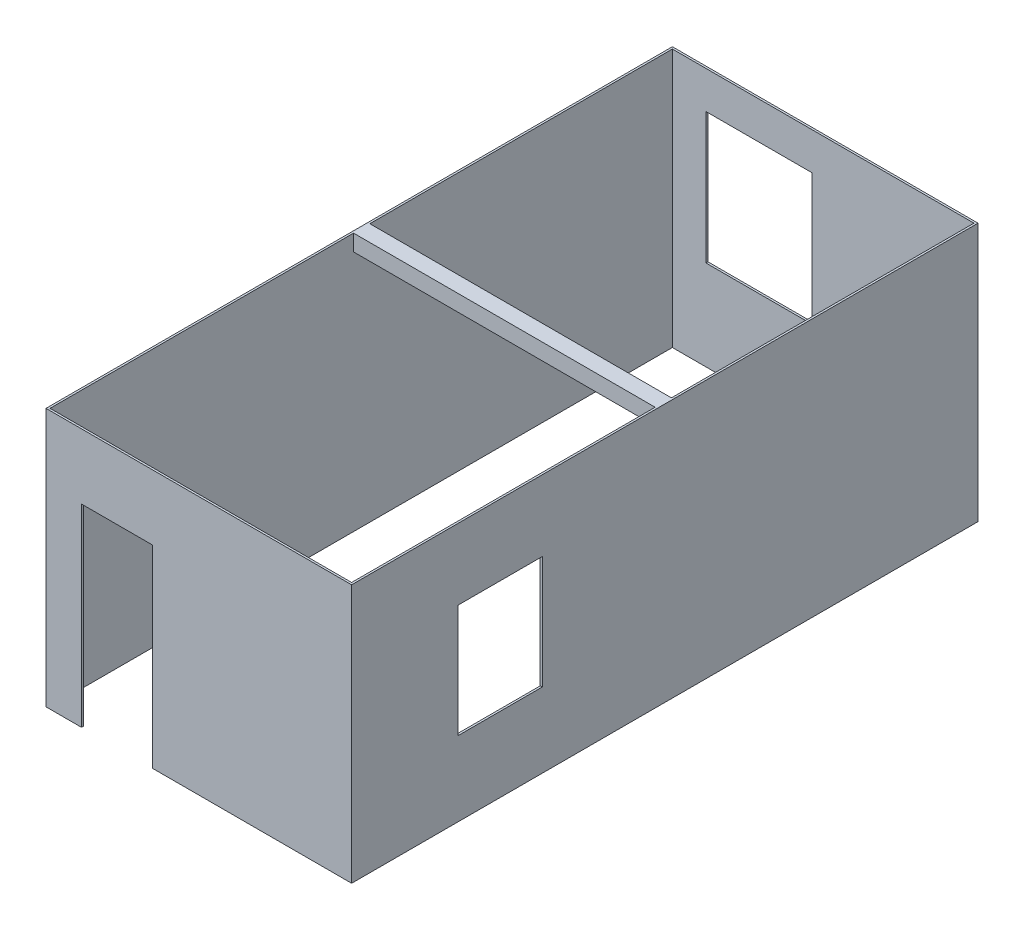
ISO-10303-21;
HEADER;
FILE_DESCRIPTION(('STEP AP214'),'2;1');
FILE_NAME('part.step','',(''),(''),'','','');
FILE_SCHEMA(('AUTOMOTIVE_DESIGN { 1 0 10303 214 1 1 1 1 }'));
ENDSEC;
DATA;
#1=APPLICATION_CONTEXT('core data for automotive mechanical design processes');
#2=APPLICATION_PROTOCOL_DEFINITION('international standard','automotive_design',2000,#1);
#3=PRODUCT_CONTEXT('',#1,'mechanical');
#4=PRODUCT('Part','Part','',(#3));
#5=PRODUCT_RELATED_PRODUCT_CATEGORY('part','',(#4));
#6=PRODUCT_DEFINITION_FORMATION('','',#4);
#7=PRODUCT_DEFINITION_CONTEXT('part definition',#1,'design');
#8=PRODUCT_DEFINITION('design','',#6,#7);
#9=PRODUCT_DEFINITION_SHAPE('','',#8);
#10=(LENGTH_UNIT() NAMED_UNIT(*) SI_UNIT(.MILLI.,.METRE.));
#11=(NAMED_UNIT(*) PLANE_ANGLE_UNIT() SI_UNIT($,.RADIAN.));
#12=(NAMED_UNIT(*) SI_UNIT($,.STERADIAN.) SOLID_ANGLE_UNIT());
#13=UNCERTAINTY_MEASURE_WITH_UNIT(LENGTH_MEASURE(1.E-05),#10,'distance_accuracy_value','');
#14=(GEOMETRIC_REPRESENTATION_CONTEXT(3) GLOBAL_UNCERTAINTY_ASSIGNED_CONTEXT((#13)) GLOBAL_UNIT_ASSIGNED_CONTEXT((#10,
#11,#12)) REPRESENTATION_CONTEXT('',''));
#15=CARTESIAN_POINT('',(0.,0.,0.));
#16=DIRECTION('',(0.,0.,1.));
#17=DIRECTION('',(1.,0.,0.));
#18=AXIS2_PLACEMENT_3D('',#15,#16,#17);
#19=CARTESIAN_POINT('',(0.,2700.,0.));
#20=DIRECTION('',(-1.,0.,0.));
#21=DIRECTION('',(0.,0.,1.));
#22=AXIS2_PLACEMENT_3D('',#19,#20,#21);
#23=PLANE('',#22);
#24=DIRECTION('',(0.,-1.,0.));
#25=VECTOR('',#24,1.);
#26=CARTESIAN_POINT('',(0.,1960.,-1970.));
#27=LINE('',#26,#25);
#28=CARTESIAN_POINT('',(0.,1960.,-1970.));
#29=VERTEX_POINT('',#28);
#30=CARTESIAN_POINT('',(0.,780.,-1970.));
#31=VERTEX_POINT('',#30);
#32=EDGE_CURVE('E277',#29,#31,#27,.T.);
#33=ORIENTED_EDGE('',*,*,#32,.F.);
#34=DIRECTION('',(0.,0.,-1.));
#35=VECTOR('',#34,1.);
#36=CARTESIAN_POINT('',(0.,1960.,-1970.));
#37=LINE('',#36,#35);
#38=CARTESIAN_POINT('',(0.,1960.,-1090.));
#39=VERTEX_POINT('',#38);
#40=EDGE_CURVE('E288',#39,#29,#37,.T.);
#41=ORIENTED_EDGE('',*,*,#40,.F.);
#42=DIRECTION('',(0.,1.,0.));
#43=VECTOR('',#42,1.);
#44=CARTESIAN_POINT('',(0.,1960.,-1090.));
#45=LINE('',#44,#43);
#46=CARTESIAN_POINT('',(0.,780.,-1090.));
#47=VERTEX_POINT('',#46);
#48=EDGE_CURVE('E302',#47,#39,#45,.T.);
#49=ORIENTED_EDGE('',*,*,#48,.F.);
#50=DIRECTION('',(0.,0.,1.));
#51=VECTOR('',#50,1.);
#52=CARTESIAN_POINT('',(0.,780.,-1970.));
#53=LINE('',#52,#51);
#54=EDGE_CURVE('E299',#31,#47,#53,.T.);
#55=ORIENTED_EDGE('',*,*,#54,.F.);
#56=EDGE_LOOP('',(#33,#41,#49,#55));
#57=FACE_BOUND('',#56,.T.);
#58=DIRECTION('',(0.,0.,-1.));
#59=VECTOR('',#58,1.);
#60=CARTESIAN_POINT('',(0.,2700.,0.));
#61=LINE('',#60,#59);
#62=CARTESIAN_POINT('',(0.,2700.,0.));
#63=VERTEX_POINT('',#62);
#64=CARTESIAN_POINT('',(0.,2700.,-3170.));
#65=VERTEX_POINT('',#64);
#66=EDGE_CURVE('E342',#63,#65,#61,.T.);
#67=ORIENTED_EDGE('',*,*,#66,.T.);
#68=DIRECTION('',(0.,1.,0.));
#69=VECTOR('',#68,1.);
#70=CARTESIAN_POINT('',(0.,2700.,-3170.));
#71=LINE('',#70,#69);
#72=CARTESIAN_POINT('',(0.,2530.,-3170.));
#73=VERTEX_POINT('',#72);
#74=EDGE_CURVE('E240',#73,#65,#71,.T.);
#75=ORIENTED_EDGE('',*,*,#74,.F.);
#76=DIRECTION('',(0.,0.,1.));
#77=VECTOR('',#76,1.);
#78=CARTESIAN_POINT('',(0.,2530.,-3340.));
#79=LINE('',#78,#77);
#80=CARTESIAN_POINT('',(0.,2530.,-3340.));
#81=VERTEX_POINT('',#80);
#82=EDGE_CURVE('E243',#81,#73,#79,.T.);
#83=ORIENTED_EDGE('',*,*,#82,.F.);
#84=DIRECTION('',(0.,-1.,0.));
#85=VECTOR('',#84,1.);
#86=CARTESIAN_POINT('',(0.,2700.,-3340.));
#87=LINE('',#86,#85);
#88=CARTESIAN_POINT('',(0.,2700.,-3340.));
#89=VERTEX_POINT('',#88);
#90=EDGE_CURVE('E74',#89,#81,#87,.T.);
#91=ORIENTED_EDGE('',*,*,#90,.F.);
#92=CARTESIAN_POINT('',(0.,2700.,-6500.));
#93=VERTEX_POINT('',#92);
#94=EDGE_CURVE('E346',#89,#93,#61,.T.);
#95=ORIENTED_EDGE('',*,*,#94,.T.);
#96=DIRECTION('',(0.,-1.,0.));
#97=VECTOR('',#96,1.);
#98=CARTESIAN_POINT('',(0.,2700.,-6500.));
#99=LINE('',#98,#97);
#100=CARTESIAN_POINT('',(0.,0.,-6500.));
#101=VERTEX_POINT('',#100);
#102=EDGE_CURVE('E371',#93,#101,#99,.T.);
#103=ORIENTED_EDGE('',*,*,#102,.T.);
#104=DIRECTION('',(0.,0.,-1.));
#105=VECTOR('',#104,1.);
#106=CARTESIAN_POINT('',(0.,0.,0.));
#107=LINE('',#106,#105);
#108=CARTESIAN_POINT('',(0.,0.,0.));
#109=VERTEX_POINT('',#108);
#110=EDGE_CURVE('E334',#109,#101,#107,.T.);
#111=ORIENTED_EDGE('',*,*,#110,.F.);
#112=DIRECTION('',(0.,-1.,0.));
#113=VECTOR('',#112,1.);
#114=CARTESIAN_POINT('',(0.,2700.,0.));
#115=LINE('',#114,#113);
#116=EDGE_CURVE('E352',#63,#109,#115,.T.);
#117=ORIENTED_EDGE('',*,*,#116,.F.);
#118=EDGE_LOOP('',(#67,#75,#83,#91,#95,#103,#111,#117));
#119=FACE_BOUND('',#118,.T.);
#120=ADVANCED_FACE('F59',(#57,#119),#23,.T.);
#121=CARTESIAN_POINT('',(-3150.,2700.,3.85763741731416E-13));
#122=DIRECTION('',(1.,0.,0.));
#123=DIRECTION('',(0.,0.,-1.));
#124=AXIS2_PLACEMENT_3D('',#121,#122,#123);
#125=PLANE('',#124);
#126=DIRECTION('',(0.,0.,-1.));
#127=VECTOR('',#126,1.);
#128=CARTESIAN_POINT('',(-3149.99999999998,2530.,-3340.));
#129=LINE('',#128,#127);
#130=CARTESIAN_POINT('',(-3150.,2530.,-3170.));
#131=VERTEX_POINT('',#130);
#132=CARTESIAN_POINT('',(-3150.00000000009,2530.,-3340.));
#133=VERTEX_POINT('',#132);
#134=EDGE_CURVE('E219',#131,#133,#129,.T.);
#135=ORIENTED_EDGE('',*,*,#134,.F.);
#136=DIRECTION('',(0.,-1.,0.));
#137=VECTOR('',#136,1.);
#138=CARTESIAN_POINT('',(-3149.99999999998,2700.,-3170.));
#139=LINE('',#138,#137);
#140=CARTESIAN_POINT('',(-3150.00000000009,2700.,-3170.));
#141=VERTEX_POINT('',#140);
#142=EDGE_CURVE('E226',#141,#131,#139,.T.);
#143=ORIENTED_EDGE('',*,*,#142,.F.);
#144=DIRECTION('',(0.,0.,1.));
#145=VECTOR('',#144,1.);
#146=CARTESIAN_POINT('',(-3150.,2700.,3.85763741731416E-13));
#147=LINE('',#146,#145);
#148=CARTESIAN_POINT('',(-3150.,2700.,3.85763741731416E-13));
#149=VERTEX_POINT('',#148);
#150=EDGE_CURVE('E348',#141,#149,#147,.T.);
#151=ORIENTED_EDGE('',*,*,#150,.T.);
#152=DIRECTION('',(0.,-1.,0.));
#153=VECTOR('',#152,1.);
#154=CARTESIAN_POINT('',(-3150.,2700.,3.85763741731416E-13));
#155=LINE('',#154,#153);
#156=CARTESIAN_POINT('',(-3150.,0.,3.85763741731416E-13));
#157=VERTEX_POINT('',#156);
#158=EDGE_CURVE('E367',#149,#157,#155,.T.);
#159=ORIENTED_EDGE('',*,*,#158,.T.);
#160=DIRECTION('',(0.,0.,1.));
#161=VECTOR('',#160,1.);
#162=CARTESIAN_POINT('',(-3150.,0.,3.85763741731416E-13));
#163=LINE('',#162,#161);
#164=CARTESIAN_POINT('',(-3150.,0.,-6500.));
#165=VERTEX_POINT('',#164);
#166=EDGE_CURVE('E358',#165,#157,#163,.T.);
#167=ORIENTED_EDGE('',*,*,#166,.F.);
#168=DIRECTION('',(0.,-1.,0.));
#169=VECTOR('',#168,1.);
#170=CARTESIAN_POINT('',(-3150.,2700.,-6500.));
#171=LINE('',#170,#169);
#172=CARTESIAN_POINT('',(-3150.,2700.,-6500.));
#173=VERTEX_POINT('',#172);
#174=EDGE_CURVE('E369',#173,#165,#171,.T.);
#175=ORIENTED_EDGE('',*,*,#174,.F.);
#176=CARTESIAN_POINT('',(-3150.00000000009,2700.,-3340.));
#177=VERTEX_POINT('',#176);
#178=EDGE_CURVE('E236',#173,#177,#147,.T.);
#179=ORIENTED_EDGE('',*,*,#178,.T.);
#180=DIRECTION('',(0.,1.,0.));
#181=VECTOR('',#180,1.);
#182=CARTESIAN_POINT('',(-3149.99999999998,2700.,-3340.));
#183=LINE('',#182,#181);
#184=EDGE_CURVE('E227',#133,#177,#183,.T.);
#185=ORIENTED_EDGE('',*,*,#184,.F.);
#186=EDGE_LOOP('',(#135,#143,#151,#159,#167,#175,#179,#185));
#187=FACE_BOUND('',#186,.T.);
#188=ADVANCED_FACE('F233',(#187),#125,.T.);
#189=CARTESIAN_POINT('',(0.,2700.,0.));
#190=DIRECTION('',(0.,1.,0.));
#191=DIRECTION('',(0.,0.,1.));
#192=AXIS2_PLACEMENT_3D('',#189,#190,#191);
#193=PLANE('',#192);
#194=ORIENTED_EDGE('',*,*,#94,.F.);
#195=DIRECTION('',(1.,0.,0.));
#196=VECTOR('',#195,1.);
#197=CARTESIAN_POINT('',(-500000.,2700.,-3340.));
#198=LINE('',#197,#196);
#199=EDGE_CURVE('E244',#177,#89,#198,.T.);
#200=ORIENTED_EDGE('',*,*,#199,.F.);
#201=ORIENTED_EDGE('',*,*,#178,.F.);
#202=DIRECTION('',(-1.,0.,0.));
#203=VECTOR('',#202,1.);
#204=CARTESIAN_POINT('',(0.,2700.,-6500.));
#205=LINE('',#204,#203);
#206=EDGE_CURVE('E345',#93,#173,#205,.T.);
#207=ORIENTED_EDGE('',*,*,#206,.F.);
#208=EDGE_LOOP('',(#194,#200,#201,#207));
#209=FACE_BOUND('',#208,.T.);
#210=DIRECTION('',(0.,0.,-1.));
#211=VECTOR('',#210,1.);
#212=CARTESIAN_POINT('',(21.,2700.,0.));
#213=LINE('',#212,#211);
#214=CARTESIAN_POINT('',(21.,2700.,21.));
#215=VERTEX_POINT('',#214);
#216=CARTESIAN_POINT('',(21.,2700.,-6521.));
#217=VERTEX_POINT('',#216);
#218=EDGE_CURVE('E375',#215,#217,#213,.T.);
#219=ORIENTED_EDGE('',*,*,#218,.T.);
#220=DIRECTION('',(-1.,0.,0.));
#221=VECTOR('',#220,1.);
#222=CARTESIAN_POINT('',(0.,2700.,-6521.));
#223=LINE('',#222,#221);
#224=CARTESIAN_POINT('',(-3171.,2700.,-6521.));
#225=VERTEX_POINT('',#224);
#226=EDGE_CURVE('E378',#217,#225,#223,.T.);
#227=ORIENTED_EDGE('',*,*,#226,.T.);
#228=DIRECTION('',(0.,0.,1.));
#229=VECTOR('',#228,1.);
#230=CARTESIAN_POINT('',(-3171.,2700.,3.85763741731416E-13));
#231=LINE('',#230,#229);
#232=CARTESIAN_POINT('',(-3171.,2700.,21.0000000000004));
#233=VERTEX_POINT('',#232);
#234=EDGE_CURVE('E381',#225,#233,#231,.T.);
#235=ORIENTED_EDGE('',*,*,#234,.T.);
#236=DIRECTION('',(1.,0.,0.));
#237=VECTOR('',#236,1.);
#238=CARTESIAN_POINT('',(0.,2700.,21.));
#239=LINE('',#238,#237);
#240=EDGE_CURVE('E383',#233,#215,#239,.T.);
#241=ORIENTED_EDGE('',*,*,#240,.T.);
#242=EDGE_LOOP('',(#219,#227,#235,#241));
#243=FACE_BOUND('',#242,.T.);
#244=DIRECTION('',(1.,0.,0.));
#245=VECTOR('',#244,1.);
#246=CARTESIAN_POINT('',(-500000.,2700.,-3170.));
#247=LINE('',#246,#245);
#248=EDGE_CURVE('E249',#141,#65,#247,.T.);
#249=ORIENTED_EDGE('',*,*,#248,.T.);
#250=ORIENTED_EDGE('',*,*,#66,.F.);
#251=DIRECTION('',(1.,0.,0.));
#252=VECTOR('',#251,1.);
#253=CARTESIAN_POINT('',(0.,2700.,0.));
#254=LINE('',#253,#252);
#255=EDGE_CURVE('E350',#149,#63,#254,.T.);
#256=ORIENTED_EDGE('',*,*,#255,.F.);
#257=ORIENTED_EDGE('',*,*,#150,.F.);
#258=EDGE_LOOP('',(#249,#250,#256,#257));
#259=FACE_BOUND('',#258,.T.);
#260=ADVANCED_FACE('F418',(#209,#243,#259),#193,.T.);
#261=CARTESIAN_POINT('',(0.,0.,0.));
#262=DIRECTION('',(0.,1.,0.));
#263=DIRECTION('',(0.,0.,1.));
#264=AXIS2_PLACEMENT_3D('',#261,#262,#263);
#265=PLANE('',#264);
#266=DIRECTION('',(1.,0.,0.));
#267=VECTOR('',#266,1.);
#268=CARTESIAN_POINT('',(0.,0.,0.));
#269=LINE('',#268,#267);
#270=CARTESIAN_POINT('',(-2800.,0.,3.42901103761259E-13));
#271=VERTEX_POINT('',#270);
#272=EDGE_CURVE('E362',#157,#271,#269,.T.);
#273=ORIENTED_EDGE('',*,*,#272,.T.);
#274=DIRECTION('',(0.,0.,-1.));
#275=VECTOR('',#274,1.);
#276=CARTESIAN_POINT('',(-2800.,0.,21.0000000000007));
#277=LINE('',#276,#275);
#278=CARTESIAN_POINT('',(-2800.,0.,21.0000000000007));
#279=VERTEX_POINT('',#278);
#280=EDGE_CURVE('E332',#279,#271,#277,.T.);
#281=ORIENTED_EDGE('',*,*,#280,.F.);
#282=DIRECTION('',(1.,0.,0.));
#283=VECTOR('',#282,1.);
#284=CARTESIAN_POINT('',(0.,0.,21.));
#285=LINE('',#284,#283);
#286=CARTESIAN_POINT('',(-3171.,0.,21.0000000000004));
#287=VERTEX_POINT('',#286);
#288=EDGE_CURVE('E379',#287,#279,#285,.T.);
#289=ORIENTED_EDGE('',*,*,#288,.F.);
#290=DIRECTION('',(0.,0.,1.));
#291=VECTOR('',#290,1.);
#292=CARTESIAN_POINT('',(-3171.,0.,3.85763741731416E-13));
#293=LINE('',#292,#291);
#294=CARTESIAN_POINT('',(-3171.,0.,-6521.));
#295=VERTEX_POINT('',#294);
#296=EDGE_CURVE('E390',#295,#287,#293,.T.);
#297=ORIENTED_EDGE('',*,*,#296,.F.);
#298=DIRECTION('',(-1.,0.,0.));
#299=VECTOR('',#298,1.);
#300=CARTESIAN_POINT('',(0.,0.,-6521.));
#301=LINE('',#300,#299);
#302=CARTESIAN_POINT('',(21.,0.,-6521.));
#303=VERTEX_POINT('',#302);
#304=EDGE_CURVE('E388',#303,#295,#301,.T.);
#305=ORIENTED_EDGE('',*,*,#304,.F.);
#306=DIRECTION('',(0.,0.,-1.));
#307=VECTOR('',#306,1.);
#308=CARTESIAN_POINT('',(21.,0.,0.));
#309=LINE('',#308,#307);
#310=CARTESIAN_POINT('',(21.,0.,21.));
#311=VERTEX_POINT('',#310);
#312=EDGE_CURVE('E374',#311,#303,#309,.T.);
#313=ORIENTED_EDGE('',*,*,#312,.F.);
#314=CARTESIAN_POINT('',(-2060.,0.,21.0000000000006));
#315=VERTEX_POINT('',#314);
#316=EDGE_CURVE('E392',#315,#311,#285,.T.);
#317=ORIENTED_EDGE('',*,*,#316,.F.);
#318=DIRECTION('',(0.,0.,-1.));
#319=VECTOR('',#318,1.);
#320=CARTESIAN_POINT('',(-2060.,0.,21.0000000000006));
#321=LINE('',#320,#319);
#322=CARTESIAN_POINT('',(-2060.,0.,2.52277240624355E-13));
#323=VERTEX_POINT('',#322);
#324=EDGE_CURVE('E335',#315,#323,#321,.T.);
#325=ORIENTED_EDGE('',*,*,#324,.T.);
#326=EDGE_CURVE('E361',#323,#109,#269,.T.);
#327=ORIENTED_EDGE('',*,*,#326,.T.);
#328=ORIENTED_EDGE('',*,*,#110,.T.);
#329=DIRECTION('',(-1.,0.,0.));
#330=VECTOR('',#329,1.);
#331=CARTESIAN_POINT('',(0.,0.,-6500.));
#332=LINE('',#331,#330);
#333=EDGE_CURVE('E355',#101,#165,#332,.T.);
#334=ORIENTED_EDGE('',*,*,#333,.T.);
#335=ORIENTED_EDGE('',*,*,#166,.T.);
#336=EDGE_LOOP('',(#273,#281,#289,#297,#305,#313,#317,#325,#327,#328,#334,#335));
#337=FACE_BOUND('',#336,.T.);
#338=ADVANCED_FACE('F409',(#337),#265,.F.);
#339=CARTESIAN_POINT('',(21.,2700.,0.));
#340=DIRECTION('',(-1.,0.,0.));
#341=DIRECTION('',(0.,0.,1.));
#342=AXIS2_PLACEMENT_3D('',#339,#340,#341);
#343=PLANE('',#342);
#344=DIRECTION('',(0.,0.,-1.));
#345=VECTOR('',#344,1.);
#346=CARTESIAN_POINT('',(21.,1960.,-1970.));
#347=LINE('',#346,#345);
#348=CARTESIAN_POINT('',(21.,1960.,-1090.));
#349=VERTEX_POINT('',#348);
#350=CARTESIAN_POINT('',(21.,1960.,-1970.));
#351=VERTEX_POINT('',#350);
#352=EDGE_CURVE('E294',#349,#351,#347,.T.);
#353=ORIENTED_EDGE('',*,*,#352,.T.);
#354=DIRECTION('',(0.,-1.,0.));
#355=VECTOR('',#354,1.);
#356=CARTESIAN_POINT('',(21.,1960.,-1970.));
#357=LINE('',#356,#355);
#358=CARTESIAN_POINT('',(21.,780.,-1970.));
#359=VERTEX_POINT('',#358);
#360=EDGE_CURVE('E284',#351,#359,#357,.T.);
#361=ORIENTED_EDGE('',*,*,#360,.T.);
#362=DIRECTION('',(0.,0.,1.));
#363=VECTOR('',#362,1.);
#364=CARTESIAN_POINT('',(21.,780.,-1970.));
#365=LINE('',#364,#363);
#366=CARTESIAN_POINT('',(21.,780.,-1090.));
#367=VERTEX_POINT('',#366);
#368=EDGE_CURVE('E287',#359,#367,#365,.T.);
#369=ORIENTED_EDGE('',*,*,#368,.T.);
#370=DIRECTION('',(0.,1.,0.));
#371=VECTOR('',#370,1.);
#372=CARTESIAN_POINT('',(21.,1960.,-1090.));
#373=LINE('',#372,#371);
#374=EDGE_CURVE('E291',#367,#349,#373,.T.);
#375=ORIENTED_EDGE('',*,*,#374,.T.);
#376=EDGE_LOOP('',(#353,#361,#369,#375));
#377=FACE_BOUND('',#376,.T.);
#378=ORIENTED_EDGE('',*,*,#312,.T.);
#379=DIRECTION('',(0.,-1.,0.));
#380=VECTOR('',#379,1.);
#381=CARTESIAN_POINT('',(21.,2700.,-6521.));
#382=LINE('',#381,#380);
#383=EDGE_CURVE('E12',#217,#303,#382,.T.);
#384=ORIENTED_EDGE('',*,*,#383,.F.);
#385=ORIENTED_EDGE('',*,*,#218,.F.);
#386=DIRECTION('',(0.,-1.,0.));
#387=VECTOR('',#386,1.);
#388=CARTESIAN_POINT('',(21.,2700.,21.));
#389=LINE('',#388,#387);
#390=EDGE_CURVE('E385',#215,#311,#389,.T.);
#391=ORIENTED_EDGE('',*,*,#390,.T.);
#392=EDGE_LOOP('',(#378,#384,#385,#391));
#393=FACE_BOUND('',#392,.T.);
#394=ADVANCED_FACE('F61',(#377,#393),#343,.F.);
#395=CARTESIAN_POINT('',(0.,2700.,-6521.));
#396=DIRECTION('',(0.,0.,1.));
#397=DIRECTION('',(1.,0.,0.));
#398=AXIS2_PLACEMENT_3D('',#395,#396,#397);
#399=PLANE('',#398);
#400=DIRECTION('',(-1.,0.,0.));
#401=VECTOR('',#400,1.);
#402=CARTESIAN_POINT('',(-2800.,2310.,-6521.));
#403=LINE('',#402,#401);
#404=CARTESIAN_POINT('',(-1690.,2310.,-6521.));
#405=VERTEX_POINT('',#404);
#406=CARTESIAN_POINT('',(-2800.,2310.,-6521.));
#407=VERTEX_POINT('',#406);
#408=EDGE_CURVE('E262',#405,#407,#403,.T.);
#409=ORIENTED_EDGE('',*,*,#408,.T.);
#410=DIRECTION('',(0.,-1.,0.));
#411=VECTOR('',#410,1.);
#412=CARTESIAN_POINT('',(-2800.,2310.,-6521.));
#413=LINE('',#412,#411);
#414=CARTESIAN_POINT('',(-2800.,940.,-6521.));
#415=VERTEX_POINT('',#414);
#416=EDGE_CURVE('E252',#407,#415,#413,.T.);
#417=ORIENTED_EDGE('',*,*,#416,.T.);
#418=DIRECTION('',(1.,0.,0.));
#419=VECTOR('',#418,1.);
#420=CARTESIAN_POINT('',(-2800.,940.,-6521.));
#421=LINE('',#420,#419);
#422=CARTESIAN_POINT('',(-1690.,940.,-6521.));
#423=VERTEX_POINT('',#422);
#424=EDGE_CURVE('E255',#415,#423,#421,.T.);
#425=ORIENTED_EDGE('',*,*,#424,.T.);
#426=DIRECTION('',(0.,1.,0.));
#427=VECTOR('',#426,1.);
#428=CARTESIAN_POINT('',(-1690.,2310.,-6521.));
#429=LINE('',#428,#427);
#430=EDGE_CURVE('E259',#423,#405,#429,.T.);
#431=ORIENTED_EDGE('',*,*,#430,.T.);
#432=EDGE_LOOP('',(#409,#417,#425,#431));
#433=FACE_BOUND('',#432,.T.);
#434=ORIENTED_EDGE('',*,*,#304,.T.);
#435=DIRECTION('',(0.,-1.,0.));
#436=VECTOR('',#435,1.);
#437=CARTESIAN_POINT('',(-3171.,2700.,-6521.));
#438=LINE('',#437,#436);
#439=EDGE_CURVE('E67',#225,#295,#438,.T.);
#440=ORIENTED_EDGE('',*,*,#439,.F.);
#441=ORIENTED_EDGE('',*,*,#226,.F.);
#442=ORIENTED_EDGE('',*,*,#383,.T.);
#443=EDGE_LOOP('',(#434,#440,#441,#442));
#444=FACE_BOUND('',#443,.T.);
#445=ADVANCED_FACE('F421',(#433,#444),#399,.F.);
#446=CARTESIAN_POINT('',(-3171.,2700.,3.85763741731416E-13));
#447=DIRECTION('',(1.,0.,0.));
#448=DIRECTION('',(0.,0.,-1.));
#449=AXIS2_PLACEMENT_3D('',#446,#447,#448);
#450=PLANE('',#449);
#451=ORIENTED_EDGE('',*,*,#296,.T.);
#452=DIRECTION('',(0.,-1.,0.));
#453=VECTOR('',#452,1.);
#454=CARTESIAN_POINT('',(-3171.,2700.,21.0000000000004));
#455=LINE('',#454,#453);
#456=EDGE_CURVE('E397',#233,#287,#455,.T.);
#457=ORIENTED_EDGE('',*,*,#456,.F.);
#458=ORIENTED_EDGE('',*,*,#234,.F.);
#459=ORIENTED_EDGE('',*,*,#439,.T.);
#460=EDGE_LOOP('',(#451,#457,#458,#459));
#461=FACE_BOUND('',#460,.T.);
#462=ADVANCED_FACE('F404',(#461),#450,.F.);
#463=CARTESIAN_POINT('',(0.,2700.,21.));
#464=DIRECTION('',(0.,0.,-1.));
#465=DIRECTION('',(-1.,0.,0.));
#466=AXIS2_PLACEMENT_3D('',#463,#464,#465);
#467=PLANE('',#466);
#468=ORIENTED_EDGE('',*,*,#288,.T.);
#469=DIRECTION('',(0.,1.,0.));
#470=VECTOR('',#469,1.);
#471=CARTESIAN_POINT('',(-2800.,0.,21.0000000000007));
#472=LINE('',#471,#470);
#473=CARTESIAN_POINT('',(-2800.,2020.,21.0000000000007));
#474=VERTEX_POINT('',#473);
#475=EDGE_CURVE('E316',#279,#474,#472,.T.);
#476=ORIENTED_EDGE('',*,*,#475,.T.);
#477=DIRECTION('',(1.,0.,0.));
#478=VECTOR('',#477,1.);
#479=CARTESIAN_POINT('',(-2800.,2020.,21.0000000000007));
#480=LINE('',#479,#478);
#481=CARTESIAN_POINT('',(-2060.,2020.,21.0000000000006));
#482=VERTEX_POINT('',#481);
#483=EDGE_CURVE('E319',#474,#482,#480,.T.);
#484=ORIENTED_EDGE('',*,*,#483,.T.);
#485=DIRECTION('',(0.,-1.,0.));
#486=VECTOR('',#485,1.);
#487=CARTESIAN_POINT('',(-2060.,0.,21.0000000000006));
#488=LINE('',#487,#486);
#489=EDGE_CURVE('E323',#482,#315,#488,.T.);
#490=ORIENTED_EDGE('',*,*,#489,.T.);
#491=ORIENTED_EDGE('',*,*,#316,.T.);
#492=ORIENTED_EDGE('',*,*,#390,.F.);
#493=ORIENTED_EDGE('',*,*,#240,.F.);
#494=ORIENTED_EDGE('',*,*,#456,.T.);
#495=EDGE_LOOP('',(#468,#476,#484,#490,#491,#492,#493,#494));
#496=FACE_BOUND('',#495,.T.);
#497=ADVANCED_FACE('F413',(#496),#467,.F.);
#498=CARTESIAN_POINT('',(0.,2700.,-6500.));
#499=DIRECTION('',(0.,0.,1.));
#500=DIRECTION('',(1.,0.,0.));
#501=AXIS2_PLACEMENT_3D('',#498,#499,#500);
#502=PLANE('',#501);
#503=DIRECTION('',(0.,-1.,0.));
#504=VECTOR('',#503,1.);
#505=CARTESIAN_POINT('',(-2800.,2310.,-6500.));
#506=LINE('',#505,#504);
#507=CARTESIAN_POINT('',(-2800.,2310.,-6500.));
#508=VERTEX_POINT('',#507);
#509=CARTESIAN_POINT('',(-2800.,940.,-6500.));
#510=VERTEX_POINT('',#509);
#511=EDGE_CURVE('E246',#508,#510,#506,.T.);
#512=ORIENTED_EDGE('',*,*,#511,.F.);
#513=DIRECTION('',(-1.,0.,0.));
#514=VECTOR('',#513,1.);
#515=CARTESIAN_POINT('',(-2800.,2310.,-6500.));
#516=LINE('',#515,#514);
#517=CARTESIAN_POINT('',(-1690.,2310.,-6500.));
#518=VERTEX_POINT('',#517);
#519=EDGE_CURVE('E256',#518,#508,#516,.T.);
#520=ORIENTED_EDGE('',*,*,#519,.F.);
#521=DIRECTION('',(0.,1.,0.));
#522=VECTOR('',#521,1.);
#523=CARTESIAN_POINT('',(-1690.,2310.,-6500.));
#524=LINE('',#523,#522);
#525=CARTESIAN_POINT('',(-1690.,940.,-6500.));
#526=VERTEX_POINT('',#525);
#527=EDGE_CURVE('E270',#526,#518,#524,.T.);
#528=ORIENTED_EDGE('',*,*,#527,.F.);
#529=DIRECTION('',(1.,0.,0.));
#530=VECTOR('',#529,1.);
#531=CARTESIAN_POINT('',(-2800.,940.,-6500.));
#532=LINE('',#531,#530);
#533=EDGE_CURVE('E267',#510,#526,#532,.T.);
#534=ORIENTED_EDGE('',*,*,#533,.F.);
#535=EDGE_LOOP('',(#512,#520,#528,#534));
#536=FACE_BOUND('',#535,.T.);
#537=ORIENTED_EDGE('',*,*,#333,.F.);
#538=ORIENTED_EDGE('',*,*,#102,.F.);
#539=ORIENTED_EDGE('',*,*,#206,.T.);
#540=ORIENTED_EDGE('',*,*,#174,.T.);
#541=EDGE_LOOP('',(#537,#538,#539,#540));
#542=FACE_BOUND('',#541,.T.);
#543=ADVANCED_FACE('F442',(#536,#542),#502,.T.);
#544=CARTESIAN_POINT('',(0.,2700.,0.));
#545=DIRECTION('',(0.,0.,-1.));
#546=DIRECTION('',(-1.,0.,0.));
#547=AXIS2_PLACEMENT_3D('',#544,#545,#546);
#548=PLANE('',#547);
#549=DIRECTION('',(0.,1.,0.));
#550=VECTOR('',#549,1.);
#551=CARTESIAN_POINT('',(-2800.,0.,3.42901103761259E-13));
#552=LINE('',#551,#550);
#553=CARTESIAN_POINT('',(-2800.,2020.,3.42901103761259E-13));
#554=VERTEX_POINT('',#553);
#555=EDGE_CURVE('E309',#271,#554,#552,.T.);
#556=ORIENTED_EDGE('',*,*,#555,.F.);
#557=ORIENTED_EDGE('',*,*,#272,.F.);
#558=ORIENTED_EDGE('',*,*,#158,.F.);
#559=ORIENTED_EDGE('',*,*,#255,.T.);
#560=ORIENTED_EDGE('',*,*,#116,.T.);
#561=ORIENTED_EDGE('',*,*,#326,.F.);
#562=DIRECTION('',(0.,-1.,0.));
#563=VECTOR('',#562,1.);
#564=CARTESIAN_POINT('',(-2060.,0.,2.52277240624355E-13));
#565=LINE('',#564,#563);
#566=CARTESIAN_POINT('',(-2060.,2020.,2.52277240624355E-13));
#567=VERTEX_POINT('',#566);
#568=EDGE_CURVE('E320',#567,#323,#565,.T.);
#569=ORIENTED_EDGE('',*,*,#568,.F.);
#570=DIRECTION('',(1.,0.,0.));
#571=VECTOR('',#570,1.);
#572=CARTESIAN_POINT('',(-2800.,2020.,3.42901103761259E-13));
#573=LINE('',#572,#571);
#574=EDGE_CURVE('E328',#554,#567,#573,.T.);
#575=ORIENTED_EDGE('',*,*,#574,.F.);
#576=EDGE_LOOP('',(#556,#557,#558,#559,#560,#561,#569,#575));
#577=FACE_BOUND('',#576,.T.);
#578=ADVANCED_FACE('F433',(#577),#548,.T.);
#579=CARTESIAN_POINT('',(-2800.,0.,21.0000000000007));
#580=DIRECTION('',(-1.,0.,0.));
#581=DIRECTION('',(0.,0.,1.));
#582=AXIS2_PLACEMENT_3D('',#579,#580,#581);
#583=PLANE('',#582);
#584=ORIENTED_EDGE('',*,*,#555,.T.);
#585=DIRECTION('',(0.,0.,-1.));
#586=VECTOR('',#585,1.);
#587=CARTESIAN_POINT('',(-2800.,2020.,21.0000000000007));
#588=LINE('',#587,#586);
#589=EDGE_CURVE('E326',#474,#554,#588,.T.);
#590=ORIENTED_EDGE('',*,*,#589,.F.);
#591=ORIENTED_EDGE('',*,*,#475,.F.);
#592=ORIENTED_EDGE('',*,*,#280,.T.);
#593=EDGE_LOOP('',(#584,#590,#591,#592));
#594=FACE_BOUND('',#593,.T.);
#595=ADVANCED_FACE('F453',(#594),#583,.F.);
#596=CARTESIAN_POINT('',(-2060.,0.,21.0000000000006));
#597=DIRECTION('',(1.,0.,0.));
#598=DIRECTION('',(0.,0.,-1.));
#599=AXIS2_PLACEMENT_3D('',#596,#597,#598);
#600=PLANE('',#599);
#601=ORIENTED_EDGE('',*,*,#568,.T.);
#602=ORIENTED_EDGE('',*,*,#324,.F.);
#603=ORIENTED_EDGE('',*,*,#489,.F.);
#604=DIRECTION('',(0.,0.,-1.));
#605=VECTOR('',#604,1.);
#606=CARTESIAN_POINT('',(-2060.,2020.,21.0000000000006));
#607=LINE('',#606,#605);
#608=EDGE_CURVE('E338',#482,#567,#607,.T.);
#609=ORIENTED_EDGE('',*,*,#608,.T.);
#610=EDGE_LOOP('',(#601,#602,#603,#609));
#611=FACE_BOUND('',#610,.T.);
#612=ADVANCED_FACE('F428',(#611),#600,.F.);
#613=CARTESIAN_POINT('',(-2800.,2020.,21.0000000000007));
#614=DIRECTION('',(0.,1.,0.));
#615=DIRECTION('',(0.,0.,1.));
#616=AXIS2_PLACEMENT_3D('',#613,#614,#615);
#617=PLANE('',#616);
#618=ORIENTED_EDGE('',*,*,#574,.T.);
#619=ORIENTED_EDGE('',*,*,#608,.F.);
#620=ORIENTED_EDGE('',*,*,#483,.F.);
#621=ORIENTED_EDGE('',*,*,#589,.T.);
#622=EDGE_LOOP('',(#618,#619,#620,#621));
#623=FACE_BOUND('',#622,.T.);
#624=ADVANCED_FACE('F455',(#623),#617,.F.);
#625=CARTESIAN_POINT('',(21.,1960.,-1970.));
#626=DIRECTION('',(0.,0.,-1.));
#627=DIRECTION('',(-1.,0.,0.));
#628=AXIS2_PLACEMENT_3D('',#625,#626,#627);
#629=PLANE('',#628);
#630=ORIENTED_EDGE('',*,*,#32,.T.);
#631=DIRECTION('',(-1.,0.,0.));
#632=VECTOR('',#631,1.);
#633=CARTESIAN_POINT('',(21.,780.,-1970.));
#634=LINE('',#633,#632);
#635=EDGE_CURVE('E297',#359,#31,#634,.T.);
#636=ORIENTED_EDGE('',*,*,#635,.F.);
#637=ORIENTED_EDGE('',*,*,#360,.F.);
#638=DIRECTION('',(-1.,0.,0.));
#639=VECTOR('',#638,1.);
#640=CARTESIAN_POINT('',(21.,1960.,-1970.));
#641=LINE('',#640,#639);
#642=EDGE_CURVE('E307',#351,#29,#641,.T.);
#643=ORIENTED_EDGE('',*,*,#642,.T.);
#644=EDGE_LOOP('',(#630,#636,#637,#643));
#645=FACE_BOUND('',#644,.T.);
#646=ADVANCED_FACE('F457',(#645),#629,.F.);
#647=CARTESIAN_POINT('',(21.,1960.,-1970.));
#648=DIRECTION('',(0.,1.,0.));
#649=DIRECTION('',(0.,0.,1.));
#650=AXIS2_PLACEMENT_3D('',#647,#648,#649);
#651=PLANE('',#650);
#652=ORIENTED_EDGE('',*,*,#40,.T.);
#653=ORIENTED_EDGE('',*,*,#642,.F.);
#654=ORIENTED_EDGE('',*,*,#352,.F.);
#655=DIRECTION('',(-1.,0.,0.));
#656=VECTOR('',#655,1.);
#657=CARTESIAN_POINT('',(21.,1960.,-1090.));
#658=LINE('',#657,#656);
#659=EDGE_CURVE('E310',#349,#39,#658,.T.);
#660=ORIENTED_EDGE('',*,*,#659,.T.);
#661=EDGE_LOOP('',(#652,#653,#654,#660));
#662=FACE_BOUND('',#661,.T.);
#663=ADVANCED_FACE('F463',(#662),#651,.F.);
#664=CARTESIAN_POINT('',(21.,1960.,-1090.));
#665=DIRECTION('',(0.,0.,1.));
#666=DIRECTION('',(0.,-1.,0.));
#667=AXIS2_PLACEMENT_3D('',#664,#665,#666);
#668=PLANE('',#667);
#669=ORIENTED_EDGE('',*,*,#48,.T.);
#670=ORIENTED_EDGE('',*,*,#659,.F.);
#671=ORIENTED_EDGE('',*,*,#374,.F.);
#672=DIRECTION('',(-1.,0.,0.));
#673=VECTOR('',#672,1.);
#674=CARTESIAN_POINT('',(21.,780.,-1090.));
#675=LINE('',#674,#673);
#676=EDGE_CURVE('E312',#367,#47,#675,.T.);
#677=ORIENTED_EDGE('',*,*,#676,.T.);
#678=EDGE_LOOP('',(#669,#670,#671,#677));
#679=FACE_BOUND('',#678,.T.);
#680=ADVANCED_FACE('F549',(#679),#668,.F.);
#681=CARTESIAN_POINT('',(21.,780.,-1970.));
#682=DIRECTION('',(0.,-1.,0.));
#683=DIRECTION('',(0.,0.,-1.));
#684=AXIS2_PLACEMENT_3D('',#681,#682,#683);
#685=PLANE('',#684);
#686=ORIENTED_EDGE('',*,*,#54,.T.);
#687=ORIENTED_EDGE('',*,*,#676,.F.);
#688=ORIENTED_EDGE('',*,*,#368,.F.);
#689=ORIENTED_EDGE('',*,*,#635,.T.);
#690=EDGE_LOOP('',(#686,#687,#688,#689));
#691=FACE_BOUND('',#690,.T.);
#692=ADVANCED_FACE('F559',(#691),#685,.F.);
#693=CARTESIAN_POINT('',(-2800.,2310.,-6521.));
#694=DIRECTION('',(-1.,0.,0.));
#695=DIRECTION('',(0.,-1.,0.));
#696=AXIS2_PLACEMENT_3D('',#693,#694,#695);
#697=PLANE('',#696);
#698=ORIENTED_EDGE('',*,*,#511,.T.);
#699=DIRECTION('',(0.,0.,1.));
#700=VECTOR('',#699,1.);
#701=CARTESIAN_POINT('',(-2800.,940.,-6521.));
#702=LINE('',#701,#700);
#703=EDGE_CURVE('E265',#415,#510,#702,.T.);
#704=ORIENTED_EDGE('',*,*,#703,.F.);
#705=ORIENTED_EDGE('',*,*,#416,.F.);
#706=DIRECTION('',(0.,0.,1.));
#707=VECTOR('',#706,1.);
#708=CARTESIAN_POINT('',(-2800.,2310.,-6521.));
#709=LINE('',#708,#707);
#710=EDGE_CURVE('E275',#407,#508,#709,.T.);
#711=ORIENTED_EDGE('',*,*,#710,.T.);
#712=EDGE_LOOP('',(#698,#704,#705,#711));
#713=FACE_BOUND('',#712,.T.);
#714=ADVANCED_FACE('F498',(#713),#697,.F.);
#715=CARTESIAN_POINT('',(-2800.,2310.,-6521.));
#716=DIRECTION('',(0.,1.,0.));
#717=DIRECTION('',(0.,0.,1.));
#718=AXIS2_PLACEMENT_3D('',#715,#716,#717);
#719=PLANE('',#718);
#720=ORIENTED_EDGE('',*,*,#519,.T.);
#721=ORIENTED_EDGE('',*,*,#710,.F.);
#722=ORIENTED_EDGE('',*,*,#408,.F.);
#723=DIRECTION('',(0.,0.,1.));
#724=VECTOR('',#723,1.);
#725=CARTESIAN_POINT('',(-1690.,2310.,-6521.));
#726=LINE('',#725,#724);
#727=EDGE_CURVE('E278',#405,#518,#726,.T.);
#728=ORIENTED_EDGE('',*,*,#727,.T.);
#729=EDGE_LOOP('',(#720,#721,#722,#728));
#730=FACE_BOUND('',#729,.T.);
#731=ADVANCED_FACE('F494',(#730),#719,.F.);
#732=CARTESIAN_POINT('',(-1690.,2310.,-6521.));
#733=DIRECTION('',(1.,0.,0.));
#734=DIRECTION('',(0.,1.,0.));
#735=AXIS2_PLACEMENT_3D('',#732,#733,#734);
#736=PLANE('',#735);
#737=ORIENTED_EDGE('',*,*,#527,.T.);
#738=ORIENTED_EDGE('',*,*,#727,.F.);
#739=ORIENTED_EDGE('',*,*,#430,.F.);
#740=DIRECTION('',(0.,0.,1.));
#741=VECTOR('',#740,1.);
#742=CARTESIAN_POINT('',(-1690.,940.,-6521.));
#743=LINE('',#742,#741);
#744=EDGE_CURVE('E280',#423,#526,#743,.T.);
#745=ORIENTED_EDGE('',*,*,#744,.T.);
#746=EDGE_LOOP('',(#737,#738,#739,#745));
#747=FACE_BOUND('',#746,.T.);
#748=ADVANCED_FACE('F506',(#747),#736,.F.);
#749=CARTESIAN_POINT('',(-2800.,940.,-6521.));
#750=DIRECTION('',(0.,-1.,0.));
#751=DIRECTION('',(0.,0.,-1.));
#752=AXIS2_PLACEMENT_3D('',#749,#750,#751);
#753=PLANE('',#752);
#754=ORIENTED_EDGE('',*,*,#533,.T.);
#755=ORIENTED_EDGE('',*,*,#744,.F.);
#756=ORIENTED_EDGE('',*,*,#424,.F.);
#757=ORIENTED_EDGE('',*,*,#703,.T.);
#758=EDGE_LOOP('',(#754,#755,#756,#757));
#759=FACE_BOUND('',#758,.T.);
#760=ADVANCED_FACE('F503',(#759),#753,.F.);
#761=CARTESIAN_POINT('',(-500000.,2700.,-3170.));
#762=DIRECTION('',(0.,0.,-1.));
#763=DIRECTION('',(-1.,0.,0.));
#764=AXIS2_PLACEMENT_3D('',#761,#762,#763);
#765=PLANE('',#764);
#766=ORIENTED_EDGE('',*,*,#248,.F.);
#767=ORIENTED_EDGE('',*,*,#142,.T.);
#768=DIRECTION('',(1.,0.,0.));
#769=VECTOR('',#768,1.);
#770=CARTESIAN_POINT('',(-500000.,2530.,-3170.));
#771=LINE('',#770,#769);
#772=EDGE_CURVE('E82',#131,#73,#771,.T.);
#773=ORIENTED_EDGE('',*,*,#772,.T.);
#774=ORIENTED_EDGE('',*,*,#74,.T.);
#775=EDGE_LOOP('',(#766,#767,#773,#774));
#776=FACE_BOUND('',#775,.T.);
#777=ADVANCED_FACE('F446',(#776),#765,.F.);
#778=CARTESIAN_POINT('',(-500000.,2700.,-3340.));
#779=DIRECTION('',(0.,0.,1.));
#780=DIRECTION('',(1.,0.,0.));
#781=AXIS2_PLACEMENT_3D('',#778,#779,#780);
#782=PLANE('',#781);
#783=DIRECTION('',(1.,0.,0.));
#784=VECTOR('',#783,1.);
#785=CARTESIAN_POINT('',(-500000.,2530.,-3340.));
#786=LINE('',#785,#784);
#787=EDGE_CURVE('E221',#133,#81,#786,.T.);
#788=ORIENTED_EDGE('',*,*,#787,.F.);
#789=ORIENTED_EDGE('',*,*,#184,.T.);
#790=ORIENTED_EDGE('',*,*,#199,.T.);
#791=ORIENTED_EDGE('',*,*,#90,.T.);
#792=EDGE_LOOP('',(#788,#789,#790,#791));
#793=FACE_BOUND('',#792,.T.);
#794=ADVANCED_FACE('F229',(#793),#782,.F.);
#795=CARTESIAN_POINT('',(-500000.,2530.,-3340.));
#796=DIRECTION('',(0.,1.,0.));
#797=DIRECTION('',(0.,0.,1.));
#798=AXIS2_PLACEMENT_3D('',#795,#796,#797);
#799=PLANE('',#798);
#800=ORIENTED_EDGE('',*,*,#772,.F.);
#801=ORIENTED_EDGE('',*,*,#134,.T.);
#802=ORIENTED_EDGE('',*,*,#787,.T.);
#803=ORIENTED_EDGE('',*,*,#82,.T.);
#804=EDGE_LOOP('',(#800,#801,#802,#803));
#805=FACE_BOUND('',#804,.T.);
#806=ADVANCED_FACE('F220',(#805),#799,.F.);
#807=CLOSED_SHELL('',(#120,#188,#260,#338,#394,#445,#462,#497,#543,#578,#595,#612,#624,#646,
#663,#680,#692,#714,#731,#748,#760,#777,#794,#806));
#808=MANIFOLD_SOLID_BREP('B2',#807);
#809=ADVANCED_BREP_SHAPE_REPRESENTATION('',(#18,#808),#14);
#810=SHAPE_DEFINITION_REPRESENTATION(#9,#809);
ENDSEC;
END-ISO-10303-21;
